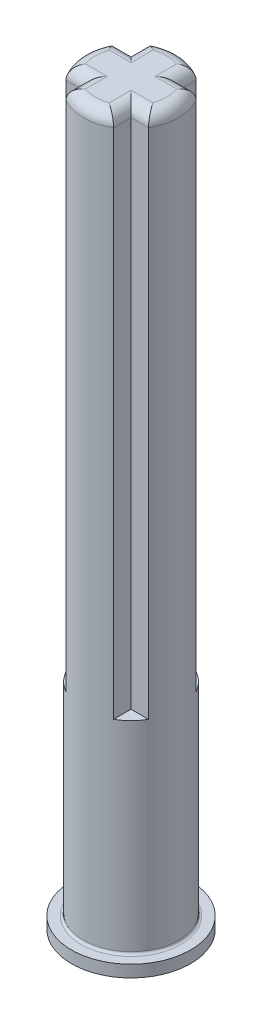
ISO-10303-21;
HEADER;
FILE_DESCRIPTION(('STEP AP214'),'2;1');
FILE_NAME('part.step','',(''),(''),'','','');
FILE_SCHEMA(('AUTOMOTIVE_DESIGN { 1 0 10303 214 1 1 1 1 }'));
ENDSEC;
DATA;
#1=APPLICATION_CONTEXT('core data for automotive mechanical design processes');
#2=APPLICATION_PROTOCOL_DEFINITION('international standard','automotive_design',2000,#1);
#3=PRODUCT_CONTEXT('',#1,'mechanical');
#4=PRODUCT('Part','Part','',(#3));
#5=PRODUCT_RELATED_PRODUCT_CATEGORY('part','',(#4));
#6=PRODUCT_DEFINITION_FORMATION('','',#4);
#7=PRODUCT_DEFINITION_CONTEXT('part definition',#1,'design');
#8=PRODUCT_DEFINITION('design','',#6,#7);
#9=PRODUCT_DEFINITION_SHAPE('','',#8);
#10=(LENGTH_UNIT() NAMED_UNIT(*) SI_UNIT(.MILLI.,.METRE.));
#11=(NAMED_UNIT(*) PLANE_ANGLE_UNIT() SI_UNIT($,.RADIAN.));
#12=(NAMED_UNIT(*) SI_UNIT($,.STERADIAN.) SOLID_ANGLE_UNIT());
#13=UNCERTAINTY_MEASURE_WITH_UNIT(LENGTH_MEASURE(1.E-05),#10,'distance_accuracy_value','');
#14=(GEOMETRIC_REPRESENTATION_CONTEXT(3) GLOBAL_UNCERTAINTY_ASSIGNED_CONTEXT((#13)) GLOBAL_UNIT_ASSIGNED_CONTEXT((#10,
#11,#12)) REPRESENTATION_CONTEXT('',''));
#15=CARTESIAN_POINT('',(0.,0.,0.));
#16=DIRECTION('',(0.,0.,1.));
#17=DIRECTION('',(1.,0.,0.));
#18=AXIS2_PLACEMENT_3D('',#15,#16,#17);
#19=CARTESIAN_POINT('',(0.,22.,0.));
#20=DIRECTION('',(0.,-1.,0.));
#21=DIRECTION('',(0.,0.,-1.));
#22=AXIS2_PLACEMENT_3D('',#19,#20,#21);
#23=CYLINDRICAL_SURFACE('',#22,2.);
#24=CARTESIAN_POINT('',(0.,-8.4,0.));
#25=DIRECTION('',(0.,-1.,0.));
#26=DIRECTION('',(0.,0.,-1.));
#27=AXIS2_PLACEMENT_3D('',#24,#25,#26);
#28=CIRCLE('',#27,2.);
#29=CARTESIAN_POINT('',(0.,-8.4,-2.));
#30=VERTEX_POINT('',#29);
#31=EDGE_CURVE('E11',#30,#30,#28,.F.);
#32=ORIENTED_EDGE('',*,*,#31,.T.);
#33=EDGE_LOOP('',(#32));
#34=FACE_BOUND('',#33,.T.);
#35=DIRECTION('',(0.,-1.,0.));
#36=VECTOR('',#35,1.);
#37=CARTESIAN_POINT('',(1.73205080756888,22.,-1.));
#38=LINE('',#37,#36);
#39=CARTESIAN_POINT('',(1.73205080756888,21.5,-1.));
#40=VERTEX_POINT('',#39);
#41=CARTESIAN_POINT('',(1.73205080756888,0.,-1.));
#42=VERTEX_POINT('',#41);
#43=EDGE_CURVE('E237',#40,#42,#38,.T.);
#44=ORIENTED_EDGE('',*,*,#43,.F.);
#45=CARTESIAN_POINT('',(0.,21.5,0.));
#46=DIRECTION('',(0.,1.,0.));
#47=DIRECTION('',(0.,0.,1.));
#48=AXIS2_PLACEMENT_3D('',#45,#46,#47);
#49=CIRCLE('',#48,2.);
#50=CARTESIAN_POINT('',(1.73205080756888,21.5,1.));
#51=VERTEX_POINT('',#50);
#52=EDGE_CURVE('E286',#40,#51,#49,.F.);
#53=ORIENTED_EDGE('',*,*,#52,.T.);
#54=DIRECTION('',(0.,-1.,0.));
#55=VECTOR('',#54,1.);
#56=CARTESIAN_POINT('',(1.73205080756888,22.,1.));
#57=LINE('',#56,#55);
#58=CARTESIAN_POINT('',(1.73205080756888,0.,1.));
#59=VERTEX_POINT('',#58);
#60=EDGE_CURVE('E208',#51,#59,#57,.T.);
#61=ORIENTED_EDGE('',*,*,#60,.T.);
#62=CARTESIAN_POINT('',(0.,0.,0.));
#63=DIRECTION('',(0.,-1.,0.));
#64=DIRECTION('',(0.,0.,-1.));
#65=AXIS2_PLACEMENT_3D('',#62,#63,#64);
#66=CIRCLE('',#65,2.);
#67=CARTESIAN_POINT('',(1.,0.,1.73205080756888));
#68=VERTEX_POINT('',#67);
#69=EDGE_CURVE('E195',#59,#68,#66,.T.);
#70=ORIENTED_EDGE('',*,*,#69,.T.);
#71=DIRECTION('',(0.,-1.,0.));
#72=VECTOR('',#71,1.);
#73=CARTESIAN_POINT('',(1.,22.,1.73205080756888));
#74=LINE('',#73,#72);
#75=CARTESIAN_POINT('',(1.,21.5,1.73205080756888));
#76=VERTEX_POINT('',#75);
#77=EDGE_CURVE('E205',#76,#68,#74,.T.);
#78=ORIENTED_EDGE('',*,*,#77,.F.);
#79=CARTESIAN_POINT('',(0.,21.5,0.));
#80=DIRECTION('',(0.,1.,0.));
#81=DIRECTION('',(0.,0.,1.));
#82=AXIS2_PLACEMENT_3D('',#79,#80,#81);
#83=CIRCLE('',#82,2.);
#84=CARTESIAN_POINT('',(-1.,21.5,1.73205080756888));
#85=VERTEX_POINT('',#84);
#86=EDGE_CURVE('E284',#76,#85,#83,.F.);
#87=ORIENTED_EDGE('',*,*,#86,.T.);
#88=DIRECTION('',(0.,-1.,0.));
#89=VECTOR('',#88,1.);
#90=CARTESIAN_POINT('',(-1.,22.,1.73205080756888));
#91=LINE('',#90,#89);
#92=CARTESIAN_POINT('',(-1.,0.,1.73205080756888));
#93=VERTEX_POINT('',#92);
#94=EDGE_CURVE('E243',#85,#93,#91,.T.);
#95=ORIENTED_EDGE('',*,*,#94,.T.);
#96=CARTESIAN_POINT('',(-1.73205080756888,0.,1.));
#97=VERTEX_POINT('',#96);
#98=EDGE_CURVE('E191',#93,#97,#66,.T.);
#99=ORIENTED_EDGE('',*,*,#98,.T.);
#100=DIRECTION('',(0.,-1.,0.));
#101=VECTOR('',#100,1.);
#102=CARTESIAN_POINT('',(-1.73205080756888,22.,1.));
#103=LINE('',#102,#101);
#104=CARTESIAN_POINT('',(-1.73205080756888,21.5,1.));
#105=VERTEX_POINT('',#104);
#106=EDGE_CURVE('E247',#105,#97,#103,.T.);
#107=ORIENTED_EDGE('',*,*,#106,.F.);
#108=CARTESIAN_POINT('',(0.,21.5,0.));
#109=DIRECTION('',(0.,1.,0.));
#110=DIRECTION('',(0.,0.,1.));
#111=AXIS2_PLACEMENT_3D('',#108,#109,#110);
#112=CIRCLE('',#111,2.);
#113=CARTESIAN_POINT('',(-1.73205080756888,21.5,-1.));
#114=VERTEX_POINT('',#113);
#115=EDGE_CURVE('E282',#105,#114,#112,.F.);
#116=ORIENTED_EDGE('',*,*,#115,.T.);
#117=DIRECTION('',(0.,-1.,0.));
#118=VECTOR('',#117,1.);
#119=CARTESIAN_POINT('',(-1.73205080756888,22.,-1.));
#120=LINE('',#119,#118);
#121=CARTESIAN_POINT('',(-1.73205080756888,0.,-1.));
#122=VERTEX_POINT('',#121);
#123=EDGE_CURVE('E190',#114,#122,#120,.T.);
#124=ORIENTED_EDGE('',*,*,#123,.T.);
#125=CARTESIAN_POINT('',(-1.,0.,-1.73205080756888));
#126=VERTEX_POINT('',#125);
#127=EDGE_CURVE('E184',#122,#126,#66,.T.);
#128=ORIENTED_EDGE('',*,*,#127,.T.);
#129=DIRECTION('',(0.,-1.,0.));
#130=VECTOR('',#129,1.);
#131=CARTESIAN_POINT('',(-1.,22.,-1.73205080756888));
#132=LINE('',#131,#130);
#133=CARTESIAN_POINT('',(-1.,21.5,-1.73205080756888));
#134=VERTEX_POINT('',#133);
#135=EDGE_CURVE('E168',#134,#126,#132,.T.);
#136=ORIENTED_EDGE('',*,*,#135,.F.);
#137=CARTESIAN_POINT('',(0.,21.5,0.));
#138=DIRECTION('',(0.,1.,0.));
#139=DIRECTION('',(0.,0.,1.));
#140=AXIS2_PLACEMENT_3D('',#137,#138,#139);
#141=CIRCLE('',#140,2.);
#142=CARTESIAN_POINT('',(1.,21.5,-1.73205080756888));
#143=VERTEX_POINT('',#142);
#144=EDGE_CURVE('E280',#134,#143,#141,.F.);
#145=ORIENTED_EDGE('',*,*,#144,.T.);
#146=DIRECTION('',(0.,-1.,0.));
#147=VECTOR('',#146,1.);
#148=CARTESIAN_POINT('',(1.,22.,-1.73205080756888));
#149=LINE('',#148,#147);
#150=CARTESIAN_POINT('',(1.,0.,-1.73205080756888));
#151=VERTEX_POINT('',#150);
#152=EDGE_CURVE('E233',#143,#151,#149,.T.);
#153=ORIENTED_EDGE('',*,*,#152,.T.);
#154=EDGE_CURVE('E187',#151,#42,#66,.T.);
#155=ORIENTED_EDGE('',*,*,#154,.T.);
#156=EDGE_LOOP('',(#44,#53,#61,#70,#78,#87,#95,#99,#107,#116,#124,#128,#136,#145,#153,#155));
#157=FACE_BOUND('',#156,.T.);
#158=ADVANCED_FACE('F41',(#34,#157),#23,.T.);
#159=CARTESIAN_POINT('',(-1.,22.,0.));
#160=DIRECTION('',(-1.,0.,0.));
#161=DIRECTION('',(0.,0.,1.));
#162=AXIS2_PLACEMENT_3D('',#159,#160,#161);
#163=PLANE('',#162);
#164=DIRECTION('',(0.,-1.,0.));
#165=VECTOR('',#164,1.);
#166=CARTESIAN_POINT('',(-1.,22.,-1.));
#167=LINE('',#166,#165);
#168=CARTESIAN_POINT('',(-1.,21.5,-1.));
#169=VERTEX_POINT('',#168);
#170=CARTESIAN_POINT('',(-1.,0.,-1.));
#171=VERTEX_POINT('',#170);
#172=EDGE_CURVE('E179',#169,#171,#167,.T.);
#173=ORIENTED_EDGE('',*,*,#172,.F.);
#174=DIRECTION('',(0.,0.,-1.));
#175=VECTOR('',#174,1.);
#176=CARTESIAN_POINT('',(-1.,21.5,0.));
#177=LINE('',#176,#175);
#178=EDGE_CURVE('E174',#169,#134,#177,.T.);
#179=ORIENTED_EDGE('',*,*,#178,.T.);
#180=ORIENTED_EDGE('',*,*,#135,.T.);
#181=DIRECTION('',(0.,0.,-1.));
#182=VECTOR('',#181,1.);
#183=CARTESIAN_POINT('',(-1.,0.,0.));
#184=LINE('',#183,#182);
#185=EDGE_CURVE('E171',#171,#126,#184,.T.);
#186=ORIENTED_EDGE('',*,*,#185,.F.);
#187=EDGE_LOOP('',(#173,#179,#180,#186));
#188=FACE_BOUND('',#187,.T.);
#189=ADVANCED_FACE('F170',(#188),#163,.T.);
#190=CARTESIAN_POINT('',(0.,22.,-1.));
#191=DIRECTION('',(0.,0.,-1.));
#192=DIRECTION('',(-1.,0.,0.));
#193=AXIS2_PLACEMENT_3D('',#190,#191,#192);
#194=PLANE('',#193);
#195=ORIENTED_EDGE('',*,*,#123,.F.);
#196=DIRECTION('',(1.,0.,0.));
#197=VECTOR('',#196,1.);
#198=CARTESIAN_POINT('',(0.,21.5,-1.));
#199=LINE('',#198,#197);
#200=EDGE_CURVE('E56',#114,#169,#199,.T.);
#201=ORIENTED_EDGE('',*,*,#200,.T.);
#202=ORIENTED_EDGE('',*,*,#172,.T.);
#203=DIRECTION('',(1.,0.,0.));
#204=VECTOR('',#203,1.);
#205=CARTESIAN_POINT('',(0.,0.,-1.));
#206=LINE('',#205,#204);
#207=EDGE_CURVE('E186',#122,#171,#206,.T.);
#208=ORIENTED_EDGE('',*,*,#207,.F.);
#209=EDGE_LOOP('',(#195,#201,#202,#208));
#210=FACE_BOUND('',#209,.T.);
#211=ADVANCED_FACE('F429',(#210),#194,.T.);
#212=CARTESIAN_POINT('',(0.,22.,1.));
#213=DIRECTION('',(0.,0.,-1.));
#214=DIRECTION('',(-1.,0.,0.));
#215=AXIS2_PLACEMENT_3D('',#212,#213,#214);
#216=PLANE('',#215);
#217=DIRECTION('',(0.,-1.,0.));
#218=VECTOR('',#217,1.);
#219=CARTESIAN_POINT('',(-1.,22.,1.));
#220=LINE('',#219,#218);
#221=CARTESIAN_POINT('',(-1.,21.5,1.));
#222=VERTEX_POINT('',#221);
#223=CARTESIAN_POINT('',(-1.,0.,1.));
#224=VERTEX_POINT('',#223);
#225=EDGE_CURVE('E245',#222,#224,#220,.T.);
#226=ORIENTED_EDGE('',*,*,#225,.F.);
#227=DIRECTION('',(1.,0.,0.));
#228=VECTOR('',#227,1.);
#229=CARTESIAN_POINT('',(-1.73205080756888,21.5,1.));
#230=LINE('',#229,#228);
#231=EDGE_CURVE('E293',#222,#105,#230,.F.);
#232=ORIENTED_EDGE('',*,*,#231,.T.);
#233=ORIENTED_EDGE('',*,*,#106,.T.);
#234=DIRECTION('',(1.,0.,0.));
#235=VECTOR('',#234,1.);
#236=CARTESIAN_POINT('',(0.,0.,1.));
#237=LINE('',#236,#235);
#238=EDGE_CURVE('E224',#97,#224,#237,.T.);
#239=ORIENTED_EDGE('',*,*,#238,.T.);
#240=EDGE_LOOP('',(#226,#232,#233,#239));
#241=FACE_BOUND('',#240,.T.);
#242=ADVANCED_FACE('F444',(#241),#216,.F.);
#243=CARTESIAN_POINT('',(-1.,22.,0.));
#244=DIRECTION('',(-1.,0.,0.));
#245=DIRECTION('',(0.,0.,1.));
#246=AXIS2_PLACEMENT_3D('',#243,#244,#245);
#247=PLANE('',#246);
#248=ORIENTED_EDGE('',*,*,#94,.F.);
#249=DIRECTION('',(0.,0.,-1.));
#250=VECTOR('',#249,1.);
#251=CARTESIAN_POINT('',(-1.,21.5,0.));
#252=LINE('',#251,#250);
#253=EDGE_CURVE('E64',#85,#222,#252,.T.);
#254=ORIENTED_EDGE('',*,*,#253,.T.);
#255=ORIENTED_EDGE('',*,*,#225,.T.);
#256=DIRECTION('',(0.,0.,-1.));
#257=VECTOR('',#256,1.);
#258=CARTESIAN_POINT('',(-1.,0.,0.));
#259=LINE('',#258,#257);
#260=EDGE_CURVE('E219',#93,#224,#259,.T.);
#261=ORIENTED_EDGE('',*,*,#260,.F.);
#262=EDGE_LOOP('',(#248,#254,#255,#261));
#263=FACE_BOUND('',#262,.T.);
#264=ADVANCED_FACE('F441',(#263),#247,.T.);
#265=CARTESIAN_POINT('',(1.,22.,0.));
#266=DIRECTION('',(-1.,0.,0.));
#267=DIRECTION('',(0.,0.,1.));
#268=AXIS2_PLACEMENT_3D('',#265,#266,#267);
#269=PLANE('',#268);
#270=DIRECTION('',(0.,-1.,0.));
#271=VECTOR('',#270,1.);
#272=CARTESIAN_POINT('',(1.,22.,1.));
#273=LINE('',#272,#271);
#274=CARTESIAN_POINT('',(1.,21.5,1.));
#275=VERTEX_POINT('',#274);
#276=CARTESIAN_POINT('',(1.,0.,1.));
#277=VERTEX_POINT('',#276);
#278=EDGE_CURVE('E240',#275,#277,#273,.T.);
#279=ORIENTED_EDGE('',*,*,#278,.F.);
#280=DIRECTION('',(0.,0.,-1.));
#281=VECTOR('',#280,1.);
#282=CARTESIAN_POINT('',(1.,21.5,1.73205080756888));
#283=LINE('',#282,#281);
#284=EDGE_CURVE('E290',#275,#76,#283,.F.);
#285=ORIENTED_EDGE('',*,*,#284,.T.);
#286=ORIENTED_EDGE('',*,*,#77,.T.);
#287=DIRECTION('',(0.,0.,-1.));
#288=VECTOR('',#287,1.);
#289=CARTESIAN_POINT('',(1.,0.,0.));
#290=LINE('',#289,#288);
#291=EDGE_CURVE('E216',#68,#277,#290,.T.);
#292=ORIENTED_EDGE('',*,*,#291,.T.);
#293=EDGE_LOOP('',(#279,#285,#286,#292));
#294=FACE_BOUND('',#293,.T.);
#295=ADVANCED_FACE('F437',(#294),#269,.F.);
#296=CARTESIAN_POINT('',(0.,22.,1.));
#297=DIRECTION('',(0.,0.,-1.));
#298=DIRECTION('',(-1.,0.,0.));
#299=AXIS2_PLACEMENT_3D('',#296,#297,#298);
#300=PLANE('',#299);
#301=ORIENTED_EDGE('',*,*,#60,.F.);
#302=DIRECTION('',(1.,0.,0.));
#303=VECTOR('',#302,1.);
#304=CARTESIAN_POINT('',(1.,21.5,1.));
#305=LINE('',#304,#303);
#306=EDGE_CURVE('E288',#51,#275,#305,.F.);
#307=ORIENTED_EDGE('',*,*,#306,.T.);
#308=ORIENTED_EDGE('',*,*,#278,.T.);
#309=DIRECTION('',(1.,0.,0.));
#310=VECTOR('',#309,1.);
#311=CARTESIAN_POINT('',(0.,0.,1.));
#312=LINE('',#311,#310);
#313=EDGE_CURVE('E214',#277,#59,#312,.T.);
#314=ORIENTED_EDGE('',*,*,#313,.T.);
#315=EDGE_LOOP('',(#301,#307,#308,#314));
#316=FACE_BOUND('',#315,.T.);
#317=ADVANCED_FACE('F434',(#316),#300,.F.);
#318=CARTESIAN_POINT('',(0.,22.,-1.));
#319=DIRECTION('',(0.,0.,-1.));
#320=DIRECTION('',(-1.,0.,0.));
#321=AXIS2_PLACEMENT_3D('',#318,#319,#320);
#322=PLANE('',#321);
#323=DIRECTION('',(0.,-1.,0.));
#324=VECTOR('',#323,1.);
#325=CARTESIAN_POINT('',(1.,22.,-1.));
#326=LINE('',#325,#324);
#327=CARTESIAN_POINT('',(1.,21.5,-1.));
#328=VERTEX_POINT('',#327);
#329=CARTESIAN_POINT('',(1.,0.,-1.));
#330=VERTEX_POINT('',#329);
#331=EDGE_CURVE('E235',#328,#330,#326,.T.);
#332=ORIENTED_EDGE('',*,*,#331,.F.);
#333=DIRECTION('',(1.,0.,0.));
#334=VECTOR('',#333,1.);
#335=CARTESIAN_POINT('',(0.,21.5,-1.));
#336=LINE('',#335,#334);
#337=EDGE_CURVE('E278',#328,#40,#336,.T.);
#338=ORIENTED_EDGE('',*,*,#337,.T.);
#339=ORIENTED_EDGE('',*,*,#43,.T.);
#340=DIRECTION('',(1.,0.,0.));
#341=VECTOR('',#340,1.);
#342=CARTESIAN_POINT('',(0.,0.,-1.));
#343=LINE('',#342,#341);
#344=EDGE_CURVE('E221',#330,#42,#343,.T.);
#345=ORIENTED_EDGE('',*,*,#344,.F.);
#346=EDGE_LOOP('',(#332,#338,#339,#345));
#347=FACE_BOUND('',#346,.T.);
#348=ADVANCED_FACE('F432',(#347),#322,.T.);
#349=CARTESIAN_POINT('',(1.,22.,0.));
#350=DIRECTION('',(-1.,0.,0.));
#351=DIRECTION('',(0.,0.,1.));
#352=AXIS2_PLACEMENT_3D('',#349,#350,#351);
#353=PLANE('',#352);
#354=ORIENTED_EDGE('',*,*,#152,.F.);
#355=DIRECTION('',(0.,0.,-1.));
#356=VECTOR('',#355,1.);
#357=CARTESIAN_POINT('',(1.,21.5,-1.));
#358=LINE('',#357,#356);
#359=EDGE_CURVE('E275',#143,#328,#358,.F.);
#360=ORIENTED_EDGE('',*,*,#359,.T.);
#361=ORIENTED_EDGE('',*,*,#331,.T.);
#362=DIRECTION('',(0.,0.,-1.));
#363=VECTOR('',#362,1.);
#364=CARTESIAN_POINT('',(1.,0.,0.));
#365=LINE('',#364,#363);
#366=EDGE_CURVE('E230',#330,#151,#365,.T.);
#367=ORIENTED_EDGE('',*,*,#366,.T.);
#368=EDGE_LOOP('',(#354,#360,#361,#367));
#369=FACE_BOUND('',#368,.T.);
#370=ADVANCED_FACE('F466',(#369),#353,.F.);
#371=CARTESIAN_POINT('',(0.,22.,0.));
#372=DIRECTION('',(0.,1.,0.));
#373=DIRECTION('',(0.,0.,1.));
#374=AXIS2_PLACEMENT_3D('',#371,#372,#373);
#375=PLANE('',#374);
#376=DIRECTION('',(1.,0.,0.));
#377=VECTOR('',#376,1.);
#378=CARTESIAN_POINT('',(0.,22.,-0.5));
#379=LINE('',#378,#377);
#380=CARTESIAN_POINT('',(1.41421356237309,22.,-0.5));
#381=VERTEX_POINT('',#380);
#382=CARTESIAN_POINT('',(0.5,22.,-0.5));
#383=VERTEX_POINT('',#382);
#384=EDGE_CURVE('E270',#381,#383,#379,.F.);
#385=ORIENTED_EDGE('',*,*,#384,.T.);
#386=DIRECTION('',(0.,0.,-1.));
#387=VECTOR('',#386,1.);
#388=CARTESIAN_POINT('',(0.5,22.,-1.73205080756888));
#389=LINE('',#388,#387);
#390=CARTESIAN_POINT('',(0.5,22.,-1.41421356237309));
#391=VERTEX_POINT('',#390);
#392=EDGE_CURVE('E272',#383,#391,#389,.T.);
#393=ORIENTED_EDGE('',*,*,#392,.T.);
#394=CARTESIAN_POINT('',(0.,22.,0.));
#395=DIRECTION('',(0.,1.,0.));
#396=DIRECTION('',(0.,0.,1.));
#397=AXIS2_PLACEMENT_3D('',#394,#395,#396);
#398=CIRCLE('',#397,1.5);
#399=CARTESIAN_POINT('',(-0.5,22.,-1.41421356237309));
#400=VERTEX_POINT('',#399);
#401=EDGE_CURVE('E178',#391,#400,#398,.T.);
#402=ORIENTED_EDGE('',*,*,#401,.T.);
#403=DIRECTION('',(0.,0.,-1.));
#404=VECTOR('',#403,1.);
#405=CARTESIAN_POINT('',(-0.5,22.,0.));
#406=LINE('',#405,#404);
#407=CARTESIAN_POINT('',(-0.5,22.,-0.5));
#408=VERTEX_POINT('',#407);
#409=EDGE_CURVE('E252',#400,#408,#406,.F.);
#410=ORIENTED_EDGE('',*,*,#409,.T.);
#411=DIRECTION('',(1.,0.,0.));
#412=VECTOR('',#411,1.);
#413=CARTESIAN_POINT('',(0.,22.,-0.5));
#414=LINE('',#413,#412);
#415=CARTESIAN_POINT('',(-1.41421356237309,22.,-0.5));
#416=VERTEX_POINT('',#415);
#417=EDGE_CURVE('E254',#408,#416,#414,.F.);
#418=ORIENTED_EDGE('',*,*,#417,.T.);
#419=CARTESIAN_POINT('',(0.,22.,0.));
#420=DIRECTION('',(0.,1.,0.));
#421=DIRECTION('',(0.,0.,1.));
#422=AXIS2_PLACEMENT_3D('',#419,#420,#421);
#423=CIRCLE('',#422,1.5);
#424=CARTESIAN_POINT('',(-1.41421356237309,22.,0.5));
#425=VERTEX_POINT('',#424);
#426=EDGE_CURVE('E256',#416,#425,#423,.T.);
#427=ORIENTED_EDGE('',*,*,#426,.T.);
#428=DIRECTION('',(1.,0.,0.));
#429=VECTOR('',#428,1.);
#430=CARTESIAN_POINT('',(-1.,22.,0.5));
#431=LINE('',#430,#429);
#432=CARTESIAN_POINT('',(-0.5,22.,0.5));
#433=VERTEX_POINT('',#432);
#434=EDGE_CURVE('E258',#425,#433,#431,.T.);
#435=ORIENTED_EDGE('',*,*,#434,.T.);
#436=DIRECTION('',(0.,0.,-1.));
#437=VECTOR('',#436,1.);
#438=CARTESIAN_POINT('',(-0.5,22.,0.));
#439=LINE('',#438,#437);
#440=CARTESIAN_POINT('',(-0.5,22.,1.41421356237309));
#441=VERTEX_POINT('',#440);
#442=EDGE_CURVE('E260',#433,#441,#439,.F.);
#443=ORIENTED_EDGE('',*,*,#442,.T.);
#444=CARTESIAN_POINT('',(0.,22.,0.));
#445=DIRECTION('',(0.,1.,0.));
#446=DIRECTION('',(0.,0.,1.));
#447=AXIS2_PLACEMENT_3D('',#444,#445,#446);
#448=CIRCLE('',#447,1.5);
#449=CARTESIAN_POINT('',(0.5,22.,1.41421356237309));
#450=VERTEX_POINT('',#449);
#451=EDGE_CURVE('E262',#441,#450,#448,.T.);
#452=ORIENTED_EDGE('',*,*,#451,.T.);
#453=DIRECTION('',(0.,0.,-1.));
#454=VECTOR('',#453,1.);
#455=CARTESIAN_POINT('',(0.5,22.,1.));
#456=LINE('',#455,#454);
#457=CARTESIAN_POINT('',(0.5,22.,0.5));
#458=VERTEX_POINT('',#457);
#459=EDGE_CURVE('E264',#450,#458,#456,.T.);
#460=ORIENTED_EDGE('',*,*,#459,.T.);
#461=DIRECTION('',(1.,0.,0.));
#462=VECTOR('',#461,1.);
#463=CARTESIAN_POINT('',(1.73205080756888,22.,0.5));
#464=LINE('',#463,#462);
#465=CARTESIAN_POINT('',(1.41421356237309,22.,0.5));
#466=VERTEX_POINT('',#465);
#467=EDGE_CURVE('E266',#458,#466,#464,.T.);
#468=ORIENTED_EDGE('',*,*,#467,.T.);
#469=CARTESIAN_POINT('',(0.,22.,0.));
#470=DIRECTION('',(0.,1.,0.));
#471=DIRECTION('',(0.,0.,1.));
#472=AXIS2_PLACEMENT_3D('',#469,#470,#471);
#473=CIRCLE('',#472,1.5);
#474=EDGE_CURVE('E268',#466,#381,#473,.T.);
#475=ORIENTED_EDGE('',*,*,#474,.T.);
#476=EDGE_LOOP('',(#385,#393,#402,#410,#418,#427,#435,#443,#452,#460,#468,#475));
#477=FACE_BOUND('',#476,.T.);
#478=ADVANCED_FACE('F512',(#477),#375,.T.);
#479=CARTESIAN_POINT('',(0.,0.,0.));
#480=DIRECTION('',(0.,-1.,0.));
#481=DIRECTION('',(0.,0.,-1.));
#482=AXIS2_PLACEMENT_3D('',#479,#480,#481);
#483=PLANE('',#482);
#484=ORIENTED_EDGE('',*,*,#366,.F.);
#485=ORIENTED_EDGE('',*,*,#344,.T.);
#486=ORIENTED_EDGE('',*,*,#154,.F.);
#487=EDGE_LOOP('',(#484,#485,#486));
#488=FACE_BOUND('',#487,.T.);
#489=ADVANCED_FACE('F506',(#488),#483,.F.);
#490=ORIENTED_EDGE('',*,*,#98,.F.);
#491=ORIENTED_EDGE('',*,*,#260,.T.);
#492=ORIENTED_EDGE('',*,*,#238,.F.);
#493=EDGE_LOOP('',(#490,#491,#492));
#494=FACE_BOUND('',#493,.T.);
#495=ADVANCED_FACE('F503',(#494),#483,.F.);
#496=ORIENTED_EDGE('',*,*,#127,.F.);
#497=ORIENTED_EDGE('',*,*,#207,.T.);
#498=ORIENTED_EDGE('',*,*,#185,.T.);
#499=EDGE_LOOP('',(#496,#497,#498));
#500=FACE_BOUND('',#499,.T.);
#501=ADVANCED_FACE('F183',(#500),#483,.F.);
#502=ORIENTED_EDGE('',*,*,#313,.F.);
#503=ORIENTED_EDGE('',*,*,#291,.F.);
#504=ORIENTED_EDGE('',*,*,#69,.F.);
#505=EDGE_LOOP('',(#502,#503,#504));
#506=FACE_BOUND('',#505,.T.);
#507=ADVANCED_FACE('F213',(#506),#483,.F.);
#508=CARTESIAN_POINT('',(0.,-8.5,0.));
#509=DIRECTION('',(0.,-1.,0.));
#510=DIRECTION('',(0.,0.,-1.));
#511=AXIS2_PLACEMENT_3D('',#508,#509,#510);
#512=CYLINDRICAL_SURFACE('',#511,2.5);
#513=CARTESIAN_POINT('',(0.,-8.5,0.));
#514=DIRECTION('',(0.,-1.,0.));
#515=DIRECTION('',(0.,0.,-1.));
#516=AXIS2_PLACEMENT_3D('',#513,#514,#515);
#517=CIRCLE('',#516,2.5);
#518=CARTESIAN_POINT('',(0.,-8.5,-2.5));
#519=VERTEX_POINT('',#518);
#520=EDGE_CURVE('E192',#519,#519,#517,.T.);
#521=ORIENTED_EDGE('',*,*,#520,.T.);
#522=EDGE_LOOP('',(#521));
#523=FACE_BOUND('',#522,.T.);
#524=CARTESIAN_POINT('',(0.,-9.,0.));
#525=DIRECTION('',(0.,-1.,0.));
#526=DIRECTION('',(0.,0.,-1.));
#527=AXIS2_PLACEMENT_3D('',#524,#525,#526);
#528=CIRCLE('',#527,2.5);
#529=CARTESIAN_POINT('',(0.,-9.,-2.5));
#530=VERTEX_POINT('',#529);
#531=EDGE_CURVE('E197',#530,#530,#528,.T.);
#532=ORIENTED_EDGE('',*,*,#531,.F.);
#533=EDGE_LOOP('',(#532));
#534=FACE_BOUND('',#533,.T.);
#535=ADVANCED_FACE('F517',(#523,#534),#512,.T.);
#536=CARTESIAN_POINT('',(0.,-8.5,0.));
#537=DIRECTION('',(0.,-1.,0.));
#538=DIRECTION('',(0.,0.,-1.));
#539=AXIS2_PLACEMENT_3D('',#536,#537,#538);
#540=PLANE('',#539);
#541=CARTESIAN_POINT('',(0.,-8.5,0.));
#542=DIRECTION('',(0.,-1.,0.));
#543=DIRECTION('',(0.,0.,-1.));
#544=AXIS2_PLACEMENT_3D('',#541,#542,#543);
#545=CIRCLE('',#544,2.1);
#546=CARTESIAN_POINT('',(0.,-8.5,-2.1));
#547=VERTEX_POINT('',#546);
#548=EDGE_CURVE('E49',#547,#547,#545,.T.);
#549=ORIENTED_EDGE('',*,*,#548,.T.);
#550=EDGE_LOOP('',(#549));
#551=FACE_BOUND('',#550,.T.);
#552=ORIENTED_EDGE('',*,*,#520,.F.);
#553=EDGE_LOOP('',(#552));
#554=FACE_BOUND('',#553,.T.);
#555=ADVANCED_FACE('F413',(#551,#554),#540,.F.);
#556=CARTESIAN_POINT('',(0.,-9.,0.));
#557=DIRECTION('',(0.,-1.,0.));
#558=DIRECTION('',(0.,0.,-1.));
#559=AXIS2_PLACEMENT_3D('',#556,#557,#558);
#560=PLANE('',#559);
#561=ORIENTED_EDGE('',*,*,#531,.T.);
#562=EDGE_LOOP('',(#561));
#563=FACE_BOUND('',#562,.T.);
#564=ADVANCED_FACE('F402',(#563),#560,.T.);
#565=CARTESIAN_POINT('',(-0.5,21.5,0.));
#566=DIRECTION('',(0.,0.,-1.));
#567=DIRECTION('',(-1.,0.,0.));
#568=AXIS2_PLACEMENT_3D('',#565,#566,#567);
#569=CYLINDRICAL_SURFACE('',#568,0.5);
#570=CARTESIAN_POINT('',(-0.5,21.5,0.5));
#571=DIRECTION('',(-0.707106781186547,0.,-0.707106781186547));
#572=DIRECTION('',(0.707106781186547,0.,-0.707106781186547));
#573=AXIS2_PLACEMENT_3D('',#570,#571,#572);
#574=ELLIPSE('',#573,0.707106781186547,0.5);
#575=EDGE_CURVE('E392',#222,#433,#574,.T.);
#576=ORIENTED_EDGE('',*,*,#575,.F.);
#577=ORIENTED_EDGE('',*,*,#253,.F.);
#578=CARTESIAN_POINT('',(-1.,21.5,1.73205080756888));
#579=CARTESIAN_POINT('',(-1.00003330520408,21.5253351979261,1.73206591767768));
#580=CARTESIAN_POINT('',(-0.998076719418973,21.5506444781614,1.73094037589118));
#581=CARTESIAN_POINT('',(-0.990449742448445,21.6004035873166,1.72653063882984));
#582=CARTESIAN_POINT('',(-0.984794254064334,21.6248564519596,1.72325510563669));
#583=CARTESIAN_POINT('',(-0.970036760566698,21.672292887405,1.71466927692418));
#584=CARTESIAN_POINT('',(-0.960937143354433,21.6952774633338,1.709360391149));
#585=CARTESIAN_POINT('',(-0.939711611456675,21.7392703713473,1.69689782397667));
#586=CARTESIAN_POINT('',(-0.927583546786681,21.7602772847788,1.68974283185335));
#587=CARTESIAN_POINT('',(-0.900164800630266,21.8008233456984,1.67343921811387));
#588=CARTESIAN_POINT('',(-0.884753873353029,21.8202498118136,1.6642137499784));
#589=CARTESIAN_POINT('',(-0.851721669798919,21.8562143591564,1.64424543411786));
#590=CARTESIAN_POINT('',(-0.834099895200241,21.8727517871822,1.63350224423147));
#591=CARTESIAN_POINT('',(-0.794889572511054,21.9046676288792,1.60932981963727));
#592=CARTESIAN_POINT('',(-0.773080188318211,21.9196468641858,1.59573269832371));
#593=CARTESIAN_POINT('',(-0.728024804168643,21.9457396326324,1.56724374336544));
#594=CARTESIAN_POINT('',(-0.70477719348377,21.9568487356661,1.55235045020791));
#595=CARTESIAN_POINT('',(-0.652172964927899,21.9772918683575,1.5181238142802));
#596=CARTESIAN_POINT('',(-0.622610366964055,21.9856772202008,1.49854109730155));
#597=CARTESIAN_POINT('',(-0.563201521264818,21.9969081174654,1.45835720220878));
#598=CARTESIAN_POINT('',(-0.53335584194601,21.9997630674559,1.43775781426434));
#599=CARTESIAN_POINT('',(-0.502507390744244,21.999995291737,1.41598572824411));
#600=CARTESIAN_POINT('',(-0.501253453419459,22.0000000056642,1.41509989443443));
#601=CARTESIAN_POINT('',(-0.5,22.,1.41421356237309));
#602=B_SPLINE_CURVE_WITH_KNOTS('',3,(#578,#579,#580,#581,#582,#583,#584,#585,#586,#587,#588,
#589,#590,#591,#592,#593,#594,#595,#596,#597,#598,#599,#600,#601),.UNSPECIFIED.,.F.,.F.,(4,2,2,
2,2,2,2,2,2,2,2,4),(0.,0.0758646178830635,0.151425446242793,0.22693398205848,0.302496276786752,
0.381550271906898,0.460622117804382,0.549516614035862,0.638512535220107,0.747359728489651,
0.85602166167748,0.860627463219885),.UNSPECIFIED.);
#603=EDGE_CURVE('E404',#441,#85,#602,.F.);
#604=ORIENTED_EDGE('',*,*,#603,.F.);
#605=ORIENTED_EDGE('',*,*,#442,.F.);
#606=EDGE_LOOP('',(#576,#577,#604,#605));
#607=FACE_BOUND('',#606,.T.);
#608=ADVANCED_FACE('F399',(#607),#569,.T.);
#609=CARTESIAN_POINT('',(0.,21.5,0.));
#610=DIRECTION('',(0.,1.,0.));
#611=DIRECTION('',(0.,0.,1.));
#612=AXIS2_PLACEMENT_3D('',#609,#610,#611);
#613=TOROIDAL_SURFACE('',#612,1.5,0.5);
#614=ORIENTED_EDGE('',*,*,#603,.T.);
#615=ORIENTED_EDGE('',*,*,#86,.F.);
#616=CARTESIAN_POINT('',(1.,21.5,1.73205080756888));
#617=CARTESIAN_POINT('',(1.00003330520408,21.5253351979261,1.73206591767768));
#618=CARTESIAN_POINT('',(0.998076719418973,21.5506444781614,1.73094037589118));
#619=CARTESIAN_POINT('',(0.990449742448445,21.6004035873166,1.72653063882984));
#620=CARTESIAN_POINT('',(0.984794254064334,21.6248564519596,1.72325510563669));
#621=CARTESIAN_POINT('',(0.970036760566698,21.672292887405,1.71466927692418));
#622=CARTESIAN_POINT('',(0.960937143354433,21.6952774633338,1.709360391149));
#623=CARTESIAN_POINT('',(0.939711611456675,21.7392703713473,1.69689782397667));
#624=CARTESIAN_POINT('',(0.927583546786681,21.7602772847788,1.68974283185335));
#625=CARTESIAN_POINT('',(0.900164800630266,21.8008233456984,1.67343921811387));
#626=CARTESIAN_POINT('',(0.884753873353029,21.8202498118136,1.6642137499784));
#627=CARTESIAN_POINT('',(0.851721669798919,21.8562143591564,1.64424543411786));
#628=CARTESIAN_POINT('',(0.834099895200241,21.8727517871822,1.63350224423147));
#629=CARTESIAN_POINT('',(0.794889572511054,21.9046676288792,1.60932981963727));
#630=CARTESIAN_POINT('',(0.773080188318211,21.9196468641858,1.59573269832371));
#631=CARTESIAN_POINT('',(0.728024804168643,21.9457396326324,1.56724374336544));
#632=CARTESIAN_POINT('',(0.70477719348377,21.9568487356661,1.55235045020791));
#633=CARTESIAN_POINT('',(0.652172964927899,21.9772918683575,1.5181238142802));
#634=CARTESIAN_POINT('',(0.622610366964055,21.9856772202008,1.49854109730155));
#635=CARTESIAN_POINT('',(0.563201521264818,21.9969081174654,1.45835720220878));
#636=CARTESIAN_POINT('',(0.53335584194601,21.9997630674559,1.43775781426434));
#637=CARTESIAN_POINT('',(0.502507390744244,21.999995291737,1.41598572824411));
#638=CARTESIAN_POINT('',(0.501253453419459,22.0000000056642,1.41509989443443));
#639=CARTESIAN_POINT('',(0.5,22.,1.41421356237309));
#640=B_SPLINE_CURVE_WITH_KNOTS('',3,(#616,#617,#618,#619,#620,#621,#622,#623,#624,#625,#626,
#627,#628,#629,#630,#631,#632,#633,#634,#635,#636,#637,#638,#639),.UNSPECIFIED.,.F.,.F.,(4,2,2,
2,2,2,2,2,2,2,2,4),(0.,0.0758646178830635,0.151425446242793,0.22693398205848,0.302496276786752,
0.381550271906898,0.460622117804382,0.549516614035862,0.638512535220107,0.747359728489651,
0.85602166167748,0.860627463219885),.UNSPECIFIED.);
#641=EDGE_CURVE('E384',#450,#76,#640,.F.);
#642=ORIENTED_EDGE('',*,*,#641,.F.);
#643=ORIENTED_EDGE('',*,*,#451,.F.);
#644=EDGE_LOOP('',(#614,#615,#642,#643));
#645=FACE_BOUND('',#644,.T.);
#646=ADVANCED_FACE('F394',(#645),#613,.T.);
#647=CARTESIAN_POINT('',(0.,21.5,0.5));
#648=DIRECTION('',(-1.,0.,0.));
#649=DIRECTION('',(0.,0.,1.));
#650=AXIS2_PLACEMENT_3D('',#647,#648,#649);
#651=CYLINDRICAL_SURFACE('',#650,0.5);
#652=ORIENTED_EDGE('',*,*,#575,.T.);
#653=ORIENTED_EDGE('',*,*,#434,.F.);
#654=CARTESIAN_POINT('',(-1.73205080756888,21.5,1.));
#655=CARTESIAN_POINT('',(-1.73206591767768,21.5253351979261,1.00003330520408));
#656=CARTESIAN_POINT('',(-1.73094037589118,21.5506444781614,0.998076719418973));
#657=CARTESIAN_POINT('',(-1.72653063882984,21.6004035873166,0.990449742448445));
#658=CARTESIAN_POINT('',(-1.72325510563669,21.6248564519596,0.984794254064334));
#659=CARTESIAN_POINT('',(-1.71466927692418,21.672292887405,0.970036760566698));
#660=CARTESIAN_POINT('',(-1.709360391149,21.6952774633338,0.960937143354433));
#661=CARTESIAN_POINT('',(-1.69689782397667,21.7392703713473,0.939711611456675));
#662=CARTESIAN_POINT('',(-1.68974283185335,21.7602772847788,0.927583546786681));
#663=CARTESIAN_POINT('',(-1.67343921811387,21.8008233456984,0.900164800630266));
#664=CARTESIAN_POINT('',(-1.6642137499784,21.8202498118136,0.884753873353029));
#665=CARTESIAN_POINT('',(-1.64424543411786,21.8562143591564,0.851721669798919));
#666=CARTESIAN_POINT('',(-1.63350224423147,21.8727517871822,0.834099895200241));
#667=CARTESIAN_POINT('',(-1.60932981963727,21.9046676288792,0.794889572511054));
#668=CARTESIAN_POINT('',(-1.59573269832371,21.9196468641858,0.773080188318211));
#669=CARTESIAN_POINT('',(-1.56724374336544,21.9457396326324,0.728024804168643));
#670=CARTESIAN_POINT('',(-1.55235045020791,21.9568487356661,0.70477719348377));
#671=CARTESIAN_POINT('',(-1.5181238142802,21.9772918683575,0.652172964927899));
#672=CARTESIAN_POINT('',(-1.49854109730155,21.9856772202008,0.622610366964054));
#673=CARTESIAN_POINT('',(-1.45835720220878,21.9969081174654,0.563201521264819));
#674=CARTESIAN_POINT('',(-1.43775781426433,21.9997630674559,0.533355841946014));
#675=CARTESIAN_POINT('',(-1.41598572824411,21.999995291737,0.502507390744244));
#676=CARTESIAN_POINT('',(-1.41509989443443,22.0000000056642,0.501253453419459));
#677=CARTESIAN_POINT('',(-1.41421356237309,22.,0.5));
#678=B_SPLINE_CURVE_WITH_KNOTS('',3,(#654,#655,#656,#657,#658,#659,#660,#661,#662,#663,#664,
#665,#666,#667,#668,#669,#670,#671,#672,#673,#674,#675,#676,#677),.UNSPECIFIED.,.F.,.F.,(4,2,2,
2,2,2,2,2,2,2,2,4),(0.,0.0758646178830635,0.151425446242793,0.22693398205848,0.302496276786752,
0.381550271906898,0.460622117804382,0.549516614035861,0.638512535220108,0.747359728489651,
0.85602166167748,0.860627463219885),.UNSPECIFIED.);
#679=EDGE_CURVE('E377',#105,#425,#678,.T.);
#680=ORIENTED_EDGE('',*,*,#679,.F.);
#681=ORIENTED_EDGE('',*,*,#231,.F.);
#682=EDGE_LOOP('',(#652,#653,#680,#681));
#683=FACE_BOUND('',#682,.T.);
#684=ADVANCED_FACE('F373',(#683),#651,.T.);
#685=CARTESIAN_POINT('',(0.5,21.5,0.));
#686=DIRECTION('',(0.,0.,1.));
#687=DIRECTION('',(1.,0.,0.));
#688=AXIS2_PLACEMENT_3D('',#685,#686,#687);
#689=CYLINDRICAL_SURFACE('',#688,0.5);
#690=ORIENTED_EDGE('',*,*,#641,.T.);
#691=ORIENTED_EDGE('',*,*,#284,.F.);
#692=CARTESIAN_POINT('',(0.5,21.5,0.5));
#693=DIRECTION('',(-0.707106781186547,0.,0.707106781186547));
#694=DIRECTION('',(-0.707106781186547,0.,-0.707106781186547));
#695=AXIS2_PLACEMENT_3D('',#692,#693,#694);
#696=ELLIPSE('',#695,0.707106781186547,0.5);
#697=EDGE_CURVE('E366',#458,#275,#696,.F.);
#698=ORIENTED_EDGE('',*,*,#697,.F.);
#699=ORIENTED_EDGE('',*,*,#459,.F.);
#700=EDGE_LOOP('',(#690,#691,#698,#699));
#701=FACE_BOUND('',#700,.T.);
#702=ADVANCED_FACE('F371',(#701),#689,.T.);
#703=CARTESIAN_POINT('',(0.,21.5,0.));
#704=DIRECTION('',(0.,1.,0.));
#705=DIRECTION('',(0.,0.,1.));
#706=AXIS2_PLACEMENT_3D('',#703,#704,#705);
#707=TOROIDAL_SURFACE('',#706,1.5,0.5);
#708=ORIENTED_EDGE('',*,*,#679,.T.);
#709=ORIENTED_EDGE('',*,*,#426,.F.);
#710=CARTESIAN_POINT('',(-1.73205080756888,21.5,-1.));
#711=CARTESIAN_POINT('',(-1.73206591767768,21.5253351979261,-1.00003330520408));
#712=CARTESIAN_POINT('',(-1.73094037589118,21.5506444781614,-0.998076719418973));
#713=CARTESIAN_POINT('',(-1.72653063882984,21.6004035873166,-0.990449742448445));
#714=CARTESIAN_POINT('',(-1.72325510563669,21.6248564519596,-0.984794254064334));
#715=CARTESIAN_POINT('',(-1.71466927692418,21.672292887405,-0.970036760566698));
#716=CARTESIAN_POINT('',(-1.709360391149,21.6952774633338,-0.960937143354433));
#717=CARTESIAN_POINT('',(-1.69689782397667,21.7392703713473,-0.939711611456675));
#718=CARTESIAN_POINT('',(-1.68974283185335,21.7602772847788,-0.927583546786681));
#719=CARTESIAN_POINT('',(-1.67343921811387,21.8008233456984,-0.900164800630266));
#720=CARTESIAN_POINT('',(-1.6642137499784,21.8202498118136,-0.884753873353029));
#721=CARTESIAN_POINT('',(-1.64424543411786,21.8562143591564,-0.851721669798919));
#722=CARTESIAN_POINT('',(-1.63350224423147,21.8727517871822,-0.834099895200241));
#723=CARTESIAN_POINT('',(-1.60932981963727,21.9046676288792,-0.794889572511054));
#724=CARTESIAN_POINT('',(-1.59573269832371,21.9196468641858,-0.773080188318211));
#725=CARTESIAN_POINT('',(-1.56724374336544,21.9457396326324,-0.728024804168643));
#726=CARTESIAN_POINT('',(-1.55235045020791,21.9568487356661,-0.70477719348377));
#727=CARTESIAN_POINT('',(-1.5181238142802,21.9772918683575,-0.652172964927899));
#728=CARTESIAN_POINT('',(-1.49854109730155,21.9856772202008,-0.622610366964054));
#729=CARTESIAN_POINT('',(-1.45835720220878,21.9969081174654,-0.563201521264819));
#730=CARTESIAN_POINT('',(-1.43775781426433,21.9997630674559,-0.533355841946014));
#731=CARTESIAN_POINT('',(-1.41598572824411,21.999995291737,-0.502507390744244));
#732=CARTESIAN_POINT('',(-1.41509989443443,22.0000000056642,-0.501253453419459));
#733=CARTESIAN_POINT('',(-1.41421356237309,22.,-0.5));
#734=B_SPLINE_CURVE_WITH_KNOTS('',3,(#710,#711,#712,#713,#714,#715,#716,#717,#718,#719,#720,
#721,#722,#723,#724,#725,#726,#727,#728,#729,#730,#731,#732,#733),.UNSPECIFIED.,.F.,.F.,(4,2,2,
2,2,2,2,2,2,2,2,4),(0.,0.0758646178830635,0.151425446242793,0.22693398205848,0.302496276786752,
0.381550271906898,0.460622117804382,0.549516614035861,0.638512535220108,0.747359728489651,
0.85602166167748,0.860627463219885),.UNSPECIFIED.);
#735=EDGE_CURVE('E359',#114,#416,#734,.T.);
#736=ORIENTED_EDGE('',*,*,#735,.F.);
#737=ORIENTED_EDGE('',*,*,#115,.F.);
#738=EDGE_LOOP('',(#708,#709,#736,#737));
#739=FACE_BOUND('',#738,.T.);
#740=ADVANCED_FACE('F348',(#739),#707,.T.);
#741=CARTESIAN_POINT('',(0.,21.5,0.5));
#742=DIRECTION('',(-1.,0.,0.));
#743=DIRECTION('',(0.,0.,1.));
#744=AXIS2_PLACEMENT_3D('',#741,#742,#743);
#745=CYLINDRICAL_SURFACE('',#744,0.5);
#746=ORIENTED_EDGE('',*,*,#697,.T.);
#747=ORIENTED_EDGE('',*,*,#306,.F.);
#748=CARTESIAN_POINT('',(1.73205080756888,21.5,1.));
#749=CARTESIAN_POINT('',(1.73206591767768,21.5253351979261,1.00003330520408));
#750=CARTESIAN_POINT('',(1.73094037589118,21.5506444781614,0.998076719418973));
#751=CARTESIAN_POINT('',(1.72653063882984,21.6004035873166,0.990449742448445));
#752=CARTESIAN_POINT('',(1.72325510563669,21.6248564519596,0.984794254064334));
#753=CARTESIAN_POINT('',(1.71466927692418,21.672292887405,0.970036760566698));
#754=CARTESIAN_POINT('',(1.709360391149,21.6952774633338,0.960937143354433));
#755=CARTESIAN_POINT('',(1.69689782397667,21.7392703713473,0.939711611456675));
#756=CARTESIAN_POINT('',(1.68974283185335,21.7602772847788,0.927583546786681));
#757=CARTESIAN_POINT('',(1.67343921811387,21.8008233456984,0.900164800630266));
#758=CARTESIAN_POINT('',(1.6642137499784,21.8202498118136,0.884753873353029));
#759=CARTESIAN_POINT('',(1.64424543411786,21.8562143591564,0.851721669798919));
#760=CARTESIAN_POINT('',(1.63350224423147,21.8727517871822,0.834099895200241));
#761=CARTESIAN_POINT('',(1.60932981963727,21.9046676288792,0.794889572511054));
#762=CARTESIAN_POINT('',(1.59573269832371,21.9196468641858,0.773080188318211));
#763=CARTESIAN_POINT('',(1.56724374336544,21.9457396326324,0.728024804168643));
#764=CARTESIAN_POINT('',(1.55235045020791,21.9568487356661,0.70477719348377));
#765=CARTESIAN_POINT('',(1.5181238142802,21.9772918683575,0.652172964927899));
#766=CARTESIAN_POINT('',(1.49854109730155,21.9856772202008,0.622610366964054));
#767=CARTESIAN_POINT('',(1.45835720220878,21.9969081174654,0.563201521264819));
#768=CARTESIAN_POINT('',(1.43775781426433,21.9997630674559,0.533355841946014));
#769=CARTESIAN_POINT('',(1.41598572824411,21.999995291737,0.502507390744244));
#770=CARTESIAN_POINT('',(1.41509989443443,22.0000000056642,0.501253453419459));
#771=CARTESIAN_POINT('',(1.41421356237309,22.,0.5));
#772=B_SPLINE_CURVE_WITH_KNOTS('',3,(#748,#749,#750,#751,#752,#753,#754,#755,#756,#757,#758,
#759,#760,#761,#762,#763,#764,#765,#766,#767,#768,#769,#770,#771),.UNSPECIFIED.,.F.,.F.,(4,2,2,
2,2,2,2,2,2,2,2,4),(0.,0.0758646178830635,0.151425446242793,0.22693398205848,0.302496276786752,
0.381550271906898,0.460622117804382,0.549516614035861,0.638512535220108,0.747359728489651,
0.85602166167748,0.860627463219885),.UNSPECIFIED.);
#773=EDGE_CURVE('E352',#466,#51,#772,.F.);
#774=ORIENTED_EDGE('',*,*,#773,.F.);
#775=ORIENTED_EDGE('',*,*,#467,.F.);
#776=EDGE_LOOP('',(#746,#747,#774,#775));
#777=FACE_BOUND('',#776,.T.);
#778=ADVANCED_FACE('F343',(#777),#745,.T.);
#779=CARTESIAN_POINT('',(0.,21.5,-0.5));
#780=DIRECTION('',(1.,0.,0.));
#781=DIRECTION('',(0.,0.,-1.));
#782=AXIS2_PLACEMENT_3D('',#779,#780,#781);
#783=CYLINDRICAL_SURFACE('',#782,0.5);
#784=ORIENTED_EDGE('',*,*,#735,.T.);
#785=ORIENTED_EDGE('',*,*,#417,.F.);
#786=CARTESIAN_POINT('',(-0.5,21.5,-0.5));
#787=DIRECTION('',(0.707106781186547,0.,-0.707106781186547));
#788=DIRECTION('',(0.707106781186547,0.,0.707106781186547));
#789=AXIS2_PLACEMENT_3D('',#786,#787,#788);
#790=ELLIPSE('',#789,0.707106781186547,0.5);
#791=EDGE_CURVE('E335',#169,#408,#790,.T.);
#792=ORIENTED_EDGE('',*,*,#791,.F.);
#793=ORIENTED_EDGE('',*,*,#200,.F.);
#794=EDGE_LOOP('',(#784,#785,#792,#793));
#795=FACE_BOUND('',#794,.T.);
#796=ADVANCED_FACE('F347',(#795),#783,.T.);
#797=CARTESIAN_POINT('',(0.,21.5,0.));
#798=DIRECTION('',(0.,1.,0.));
#799=DIRECTION('',(0.,0.,1.));
#800=AXIS2_PLACEMENT_3D('',#797,#798,#799);
#801=TOROIDAL_SURFACE('',#800,1.5,0.5);
#802=ORIENTED_EDGE('',*,*,#773,.T.);
#803=ORIENTED_EDGE('',*,*,#52,.F.);
#804=CARTESIAN_POINT('',(1.73205080756888,21.5,-1.));
#805=CARTESIAN_POINT('',(1.73206591767768,21.5253351979261,-1.00003330520408));
#806=CARTESIAN_POINT('',(1.73094037589118,21.5506444781614,-0.998076719418973));
#807=CARTESIAN_POINT('',(1.72653063882984,21.6004035873166,-0.990449742448445));
#808=CARTESIAN_POINT('',(1.72325510563669,21.6248564519596,-0.984794254064334));
#809=CARTESIAN_POINT('',(1.71466927692418,21.672292887405,-0.970036760566698));
#810=CARTESIAN_POINT('',(1.709360391149,21.6952774633338,-0.960937143354433));
#811=CARTESIAN_POINT('',(1.69689782397667,21.7392703713473,-0.939711611456675));
#812=CARTESIAN_POINT('',(1.68974283185335,21.7602772847788,-0.927583546786681));
#813=CARTESIAN_POINT('',(1.67343921811387,21.8008233456984,-0.900164800630266));
#814=CARTESIAN_POINT('',(1.6642137499784,21.8202498118136,-0.884753873353029));
#815=CARTESIAN_POINT('',(1.64424543411786,21.8562143591564,-0.851721669798919));
#816=CARTESIAN_POINT('',(1.63350224423147,21.8727517871822,-0.834099895200241));
#817=CARTESIAN_POINT('',(1.60932981963727,21.9046676288792,-0.794889572511054));
#818=CARTESIAN_POINT('',(1.59573269832371,21.9196468641858,-0.773080188318211));
#819=CARTESIAN_POINT('',(1.56724374336544,21.9457396326324,-0.728024804168643));
#820=CARTESIAN_POINT('',(1.55235045020791,21.9568487356661,-0.70477719348377));
#821=CARTESIAN_POINT('',(1.5181238142802,21.9772918683575,-0.652172964927899));
#822=CARTESIAN_POINT('',(1.49854109730155,21.9856772202008,-0.622610366964054));
#823=CARTESIAN_POINT('',(1.45835720220878,21.9969081174654,-0.563201521264819));
#824=CARTESIAN_POINT('',(1.43775781426433,21.9997630674559,-0.533355841946014));
#825=CARTESIAN_POINT('',(1.41598572824411,21.999995291737,-0.502507390744244));
#826=CARTESIAN_POINT('',(1.41509989443443,22.0000000056642,-0.501253453419459));
#827=CARTESIAN_POINT('',(1.41421356237309,22.,-0.5));
#828=B_SPLINE_CURVE_WITH_KNOTS('',3,(#804,#805,#806,#807,#808,#809,#810,#811,#812,#813,#814,
#815,#816,#817,#818,#819,#820,#821,#822,#823,#824,#825,#826,#827),.UNSPECIFIED.,.F.,.F.,(4,2,2,
2,2,2,2,2,2,2,2,4),(0.,0.0758646178830635,0.151425446242793,0.22693398205848,0.302496276786752,
0.381550271906898,0.460622117804382,0.549516614035861,0.638512535220108,0.747359728489651,
0.85602166167748,0.860627463219885),.UNSPECIFIED.);
#829=EDGE_CURVE('E327',#381,#40,#828,.F.);
#830=ORIENTED_EDGE('',*,*,#829,.F.);
#831=ORIENTED_EDGE('',*,*,#474,.F.);
#832=EDGE_LOOP('',(#802,#803,#830,#831));
#833=FACE_BOUND('',#832,.T.);
#834=ADVANCED_FACE('F337',(#833),#801,.T.);
#835=CARTESIAN_POINT('',(-0.5,21.5,0.));
#836=DIRECTION('',(0.,0.,-1.));
#837=DIRECTION('',(-1.,0.,0.));
#838=AXIS2_PLACEMENT_3D('',#835,#836,#837);
#839=CYLINDRICAL_SURFACE('',#838,0.5);
#840=ORIENTED_EDGE('',*,*,#791,.T.);
#841=ORIENTED_EDGE('',*,*,#409,.F.);
#842=CARTESIAN_POINT('',(-1.,21.5,-1.73205080756888));
#843=CARTESIAN_POINT('',(-1.00003330520408,21.5253351979261,-1.73206591767768));
#844=CARTESIAN_POINT('',(-0.998076719418973,21.5506444781614,-1.73094037589118));
#845=CARTESIAN_POINT('',(-0.990449742448445,21.6004035873166,-1.72653063882984));
#846=CARTESIAN_POINT('',(-0.984794254064334,21.6248564519596,-1.72325510563669));
#847=CARTESIAN_POINT('',(-0.970036760566698,21.672292887405,-1.71466927692418));
#848=CARTESIAN_POINT('',(-0.960937143354433,21.6952774633338,-1.709360391149));
#849=CARTESIAN_POINT('',(-0.939711611456675,21.7392703713473,-1.69689782397667));
#850=CARTESIAN_POINT('',(-0.927583546786681,21.7602772847788,-1.68974283185335));
#851=CARTESIAN_POINT('',(-0.900164800630266,21.8008233456984,-1.67343921811387));
#852=CARTESIAN_POINT('',(-0.884753873353029,21.8202498118136,-1.6642137499784));
#853=CARTESIAN_POINT('',(-0.851721669798919,21.8562143591564,-1.64424543411786));
#854=CARTESIAN_POINT('',(-0.834099895200241,21.8727517871822,-1.63350224423147));
#855=CARTESIAN_POINT('',(-0.794889572511054,21.9046676288792,-1.60932981963727));
#856=CARTESIAN_POINT('',(-0.773080188318211,21.9196468641858,-1.59573269832371));
#857=CARTESIAN_POINT('',(-0.728024804168643,21.9457396326324,-1.56724374336544));
#858=CARTESIAN_POINT('',(-0.70477719348377,21.9568487356661,-1.55235045020791));
#859=CARTESIAN_POINT('',(-0.652172964927899,21.9772918683575,-1.5181238142802));
#860=CARTESIAN_POINT('',(-0.622610366964055,21.9856772202008,-1.49854109730155));
#861=CARTESIAN_POINT('',(-0.563201521264818,21.9969081174654,-1.45835720220878));
#862=CARTESIAN_POINT('',(-0.53335584194601,21.9997630674559,-1.43775781426434));
#863=CARTESIAN_POINT('',(-0.502507390744244,21.999995291737,-1.41598572824411));
#864=CARTESIAN_POINT('',(-0.501253453419459,22.0000000056642,-1.41509989443443));
#865=CARTESIAN_POINT('',(-0.5,22.,-1.41421356237309));
#866=B_SPLINE_CURVE_WITH_KNOTS('',3,(#842,#843,#844,#845,#846,#847,#848,#849,#850,#851,#852,
#853,#854,#855,#856,#857,#858,#859,#860,#861,#862,#863,#864,#865),.UNSPECIFIED.,.F.,.F.,(4,2,2,
2,2,2,2,2,2,2,2,4),(0.,0.0758646178830635,0.151425446242793,0.22693398205848,0.302496276786752,
0.381550271906898,0.460622117804382,0.549516614035862,0.638512535220107,0.747359728489651,
0.85602166167748,0.860627463219885),.UNSPECIFIED.);
#867=EDGE_CURVE('E320',#134,#400,#866,.T.);
#868=ORIENTED_EDGE('',*,*,#867,.F.);
#869=ORIENTED_EDGE('',*,*,#178,.F.);
#870=EDGE_LOOP('',(#840,#841,#868,#869));
#871=FACE_BOUND('',#870,.T.);
#872=ADVANCED_FACE('F316',(#871),#839,.T.);
#873=CARTESIAN_POINT('',(0.,21.5,-0.5));
#874=DIRECTION('',(1.,0.,0.));
#875=DIRECTION('',(0.,0.,-1.));
#876=AXIS2_PLACEMENT_3D('',#873,#874,#875);
#877=CYLINDRICAL_SURFACE('',#876,0.5);
#878=ORIENTED_EDGE('',*,*,#829,.T.);
#879=ORIENTED_EDGE('',*,*,#337,.F.);
#880=CARTESIAN_POINT('',(0.5,21.5,-0.5));
#881=DIRECTION('',(0.707106781186547,0.,0.707106781186547));
#882=DIRECTION('',(-0.707106781186547,0.,0.707106781186547));
#883=AXIS2_PLACEMENT_3D('',#880,#881,#882);
#884=ELLIPSE('',#883,0.707106781186547,0.5);
#885=EDGE_CURVE('E305',#383,#328,#884,.F.);
#886=ORIENTED_EDGE('',*,*,#885,.F.);
#887=ORIENTED_EDGE('',*,*,#384,.F.);
#888=EDGE_LOOP('',(#878,#879,#886,#887));
#889=FACE_BOUND('',#888,.T.);
#890=ADVANCED_FACE('F314',(#889),#877,.T.);
#891=CARTESIAN_POINT('',(0.,21.5,0.));
#892=DIRECTION('',(0.,1.,0.));
#893=DIRECTION('',(0.,0.,1.));
#894=AXIS2_PLACEMENT_3D('',#891,#892,#893);
#895=TOROIDAL_SURFACE('',#894,1.5,0.5);
#896=ORIENTED_EDGE('',*,*,#867,.T.);
#897=ORIENTED_EDGE('',*,*,#401,.F.);
#898=CARTESIAN_POINT('',(1.,21.5,-1.73205080756888));
#899=CARTESIAN_POINT('',(1.00003330520408,21.5253351979261,-1.73206591767768));
#900=CARTESIAN_POINT('',(0.998076719418973,21.5506444781614,-1.73094037589118));
#901=CARTESIAN_POINT('',(0.990449742448445,21.6004035873166,-1.72653063882984));
#902=CARTESIAN_POINT('',(0.984794254064334,21.6248564519596,-1.72325510563669));
#903=CARTESIAN_POINT('',(0.970036760566698,21.672292887405,-1.71466927692418));
#904=CARTESIAN_POINT('',(0.960937143354433,21.6952774633338,-1.709360391149));
#905=CARTESIAN_POINT('',(0.939711611456675,21.7392703713473,-1.69689782397667));
#906=CARTESIAN_POINT('',(0.927583546786681,21.7602772847788,-1.68974283185335));
#907=CARTESIAN_POINT('',(0.900164800630266,21.8008233456984,-1.67343921811387));
#908=CARTESIAN_POINT('',(0.884753873353029,21.8202498118136,-1.6642137499784));
#909=CARTESIAN_POINT('',(0.851721669798919,21.8562143591564,-1.64424543411786));
#910=CARTESIAN_POINT('',(0.834099895200241,21.8727517871822,-1.63350224423147));
#911=CARTESIAN_POINT('',(0.794889572511054,21.9046676288792,-1.60932981963727));
#912=CARTESIAN_POINT('',(0.773080188318211,21.9196468641858,-1.59573269832371));
#913=CARTESIAN_POINT('',(0.728024804168643,21.9457396326324,-1.56724374336544));
#914=CARTESIAN_POINT('',(0.70477719348377,21.9568487356661,-1.55235045020791));
#915=CARTESIAN_POINT('',(0.652172964927899,21.9772918683575,-1.5181238142802));
#916=CARTESIAN_POINT('',(0.622610366964055,21.9856772202008,-1.49854109730155));
#917=CARTESIAN_POINT('',(0.563201521264818,21.9969081174654,-1.45835720220878));
#918=CARTESIAN_POINT('',(0.53335584194601,21.9997630674559,-1.43775781426434));
#919=CARTESIAN_POINT('',(0.502507390744244,21.999995291737,-1.41598572824411));
#920=CARTESIAN_POINT('',(0.501253453419459,22.0000000056642,-1.41509989443443));
#921=CARTESIAN_POINT('',(0.5,22.,-1.41421356237309));
#922=B_SPLINE_CURVE_WITH_KNOTS('',3,(#898,#899,#900,#901,#902,#903,#904,#905,#906,#907,#908,
#909,#910,#911,#912,#913,#914,#915,#916,#917,#918,#919,#920,#921),.UNSPECIFIED.,.F.,.F.,(4,2,2,
2,2,2,2,2,2,2,2,4),(0.,0.0758646178830635,0.151425446242793,0.22693398205848,0.302496276786752,
0.381550271906898,0.460622117804382,0.549516614035862,0.638512535220107,0.747359728489651,
0.85602166167748,0.860627463219885),.UNSPECIFIED.);
#923=EDGE_CURVE('E297',#143,#391,#922,.T.);
#924=ORIENTED_EDGE('',*,*,#923,.F.);
#925=ORIENTED_EDGE('',*,*,#144,.F.);
#926=EDGE_LOOP('',(#896,#897,#924,#925));
#927=FACE_BOUND('',#926,.T.);
#928=ADVANCED_FACE('F310',(#927),#895,.T.);
#929=CARTESIAN_POINT('',(0.5,21.5,0.));
#930=DIRECTION('',(0.,0.,1.));
#931=DIRECTION('',(1.,0.,0.));
#932=AXIS2_PLACEMENT_3D('',#929,#930,#931);
#933=CYLINDRICAL_SURFACE('',#932,0.5);
#934=ORIENTED_EDGE('',*,*,#885,.T.);
#935=ORIENTED_EDGE('',*,*,#359,.F.);
#936=ORIENTED_EDGE('',*,*,#923,.T.);
#937=ORIENTED_EDGE('',*,*,#392,.F.);
#938=EDGE_LOOP('',(#934,#935,#936,#937));
#939=FACE_BOUND('',#938,.T.);
#940=ADVANCED_FACE('F307',(#939),#933,.T.);
#941=CARTESIAN_POINT('',(0.,-8.4,0.));
#942=DIRECTION('',(0.,-1.,0.));
#943=DIRECTION('',(0.,0.,-1.));
#944=AXIS2_PLACEMENT_3D('',#941,#942,#943);
#945=TOROIDAL_SURFACE('',#944,2.1,0.1);
#946=ORIENTED_EDGE('',*,*,#31,.F.);
#947=EDGE_LOOP('',(#946));
#948=FACE_BOUND('',#947,.T.);
#949=ORIENTED_EDGE('',*,*,#548,.F.);
#950=EDGE_LOOP('',(#949));
#951=FACE_BOUND('',#950,.T.);
#952=ADVANCED_FACE('F43',(#948,#951),#945,.F.);
#953=CLOSED_SHELL('',(#158,#189,#211,#242,#264,#295,#317,#348,#370,#478,#489,#495,#501,#507,
#535,#555,#564,#608,#646,#684,#702,#740,#778,#796,#834,#872,#890,#928,#940,#952));
#954=MANIFOLD_SOLID_BREP('B2',#953);
#955=ADVANCED_BREP_SHAPE_REPRESENTATION('',(#18,#954),#14);
#956=SHAPE_DEFINITION_REPRESENTATION(#9,#955);
ENDSEC;
END-ISO-10303-21;
